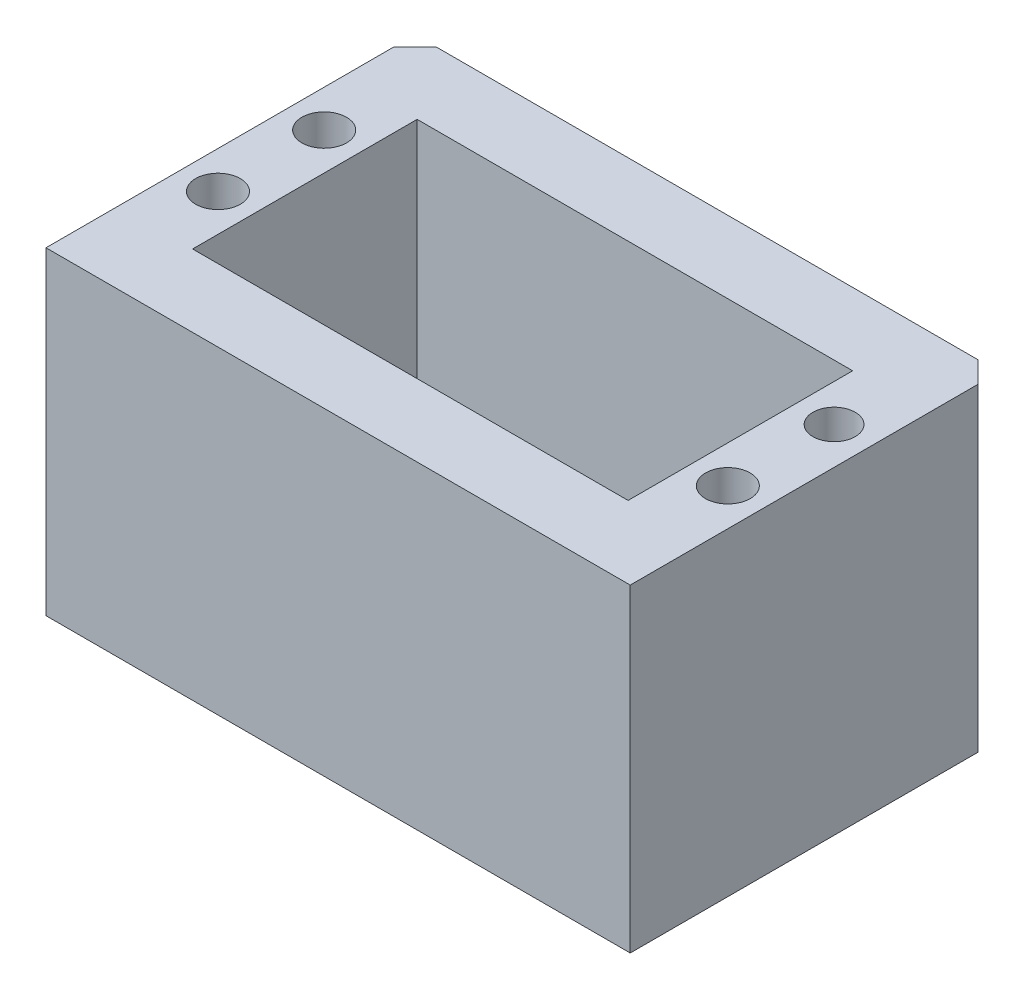
ISO-10303-21;
HEADER;
FILE_DESCRIPTION(('STEP AP214'),'2;1');
FILE_NAME('part.step','',(''),(''),'','','');
FILE_SCHEMA(('AUTOMOTIVE_DESIGN { 1 0 10303 214 1 1 1 1 }'));
ENDSEC;
DATA;
#1=APPLICATION_CONTEXT('core data for automotive mechanical design processes');
#2=APPLICATION_PROTOCOL_DEFINITION('international standard','automotive_design',2000,#1);
#3=PRODUCT_CONTEXT('',#1,'mechanical');
#4=PRODUCT('Part','Part','',(#3));
#5=PRODUCT_RELATED_PRODUCT_CATEGORY('part','',(#4));
#6=PRODUCT_DEFINITION_FORMATION('','',#4);
#7=PRODUCT_DEFINITION_CONTEXT('part definition',#1,'design');
#8=PRODUCT_DEFINITION('design','',#6,#7);
#9=PRODUCT_DEFINITION_SHAPE('','',#8);
#10=(LENGTH_UNIT() NAMED_UNIT(*) SI_UNIT(.MILLI.,.METRE.));
#11=(NAMED_UNIT(*) PLANE_ANGLE_UNIT() SI_UNIT($,.RADIAN.));
#12=(NAMED_UNIT(*) SI_UNIT($,.STERADIAN.) SOLID_ANGLE_UNIT());
#13=UNCERTAINTY_MEASURE_WITH_UNIT(LENGTH_MEASURE(1.E-05),#10,'distance_accuracy_value','');
#14=(GEOMETRIC_REPRESENTATION_CONTEXT(3) GLOBAL_UNCERTAINTY_ASSIGNED_CONTEXT((#13)) GLOBAL_UNIT_ASSIGNED_CONTEXT((#10,
#11,#12)) REPRESENTATION_CONTEXT('',''));
#15=CARTESIAN_POINT('',(0.,0.,0.));
#16=DIRECTION('',(0.,0.,1.));
#17=DIRECTION('',(1.,0.,0.));
#18=AXIS2_PLACEMENT_3D('',#15,#16,#17);
#19=CARTESIAN_POINT('',(0.,30.,0.));
#20=DIRECTION('',(1.,0.,0.));
#21=DIRECTION('',(0.,0.,-1.));
#22=AXIS2_PLACEMENT_3D('',#19,#20,#21);
#23=PLANE('',#22);
#24=DIRECTION('',(0.,0.,1.));
#25=VECTOR('',#24,1.);
#26=CARTESIAN_POINT('',(0.,4.4,-21.1901532724234));
#27=LINE('',#26,#25);
#28=CARTESIAN_POINT('',(0.,4.4,-21.1901532724234));
#29=VERTEX_POINT('',#28);
#30=CARTESIAN_POINT('',(0.,4.4,-14.1901532724234));
#31=VERTEX_POINT('',#30);
#32=EDGE_CURVE('E156',#29,#31,#27,.T.);
#33=ORIENTED_EDGE('',*,*,#32,.F.);
#34=DIRECTION('',(0.,-1.,0.));
#35=VECTOR('',#34,1.);
#36=CARTESIAN_POINT('',(0.,8.6,-21.1901532724234));
#37=LINE('',#36,#35);
#38=CARTESIAN_POINT('',(0.,8.6,-21.1901532724234));
#39=VERTEX_POINT('',#38);
#40=EDGE_CURVE('E161',#39,#29,#37,.T.);
#41=ORIENTED_EDGE('',*,*,#40,.F.);
#42=DIRECTION('',(0.,0.,-1.));
#43=VECTOR('',#42,1.);
#44=CARTESIAN_POINT('',(0.,8.6,-21.1901532724234));
#45=LINE('',#44,#43);
#46=CARTESIAN_POINT('',(0.,8.6,-14.1901532724234));
#47=VERTEX_POINT('',#46);
#48=EDGE_CURVE('E165',#47,#39,#45,.T.);
#49=ORIENTED_EDGE('',*,*,#48,.F.);
#50=DIRECTION('',(0.,1.,0.));
#51=VECTOR('',#50,1.);
#52=CARTESIAN_POINT('',(0.,8.6,-14.1901532724234));
#53=LINE('',#52,#51);
#54=EDGE_CURVE('E145',#31,#47,#53,.T.);
#55=ORIENTED_EDGE('',*,*,#54,.F.);
#56=EDGE_LOOP('',(#33,#41,#49,#55));
#57=FACE_BOUND('',#56,.T.);
#58=DIRECTION('',(0.,0.,1.));
#59=VECTOR('',#58,1.);
#60=CARTESIAN_POINT('',(0.,30.,0.));
#61=LINE('',#60,#59);
#62=CARTESIAN_POINT('',(0.,30.,-32.7401532724234));
#63=VERTEX_POINT('',#62);
#64=CARTESIAN_POINT('',(0.,30.,0.));
#65=VERTEX_POINT('',#64);
#66=EDGE_CURVE('E207',#63,#65,#61,.T.);
#67=ORIENTED_EDGE('',*,*,#66,.F.);
#68=DIRECTION('',(0.,-1.,0.));
#69=VECTOR('',#68,1.);
#70=CARTESIAN_POINT('',(0.,30.,-32.7401532724234));
#71=LINE('',#70,#69);
#72=CARTESIAN_POINT('',(0.,0.,-32.7401532724234));
#73=VERTEX_POINT('',#72);
#74=EDGE_CURVE('E11',#63,#73,#71,.T.);
#75=ORIENTED_EDGE('',*,*,#74,.T.);
#76=DIRECTION('',(0.,0.,1.));
#77=VECTOR('',#76,1.);
#78=CARTESIAN_POINT('',(0.,0.,0.));
#79=LINE('',#78,#77);
#80=CARTESIAN_POINT('',(0.,0.,0.));
#81=VERTEX_POINT('',#80);
#82=EDGE_CURVE('E200',#73,#81,#79,.T.);
#83=ORIENTED_EDGE('',*,*,#82,.T.);
#84=DIRECTION('',(0.,-1.,0.));
#85=VECTOR('',#84,1.);
#86=CARTESIAN_POINT('',(0.,30.,0.));
#87=LINE('',#86,#85);
#88=EDGE_CURVE('E226',#65,#81,#87,.T.);
#89=ORIENTED_EDGE('',*,*,#88,.F.);
#90=EDGE_LOOP('',(#67,#75,#83,#89));
#91=FACE_BOUND('',#90,.T.);
#92=ADVANCED_FACE('F35',(#57,#91),#23,.F.);
#93=CARTESIAN_POINT('',(0.,30.,0.));
#94=DIRECTION('',(0.,0.,-1.));
#95=DIRECTION('',(-1.,0.,0.));
#96=AXIS2_PLACEMENT_3D('',#93,#94,#95);
#97=PLANE('',#96);
#98=DIRECTION('',(1.,0.,0.));
#99=VECTOR('',#98,1.);
#100=CARTESIAN_POINT('',(0.,0.,0.));
#101=LINE('',#100,#99);
#102=CARTESIAN_POINT('',(55.,0.,0.));
#103=VERTEX_POINT('',#102);
#104=EDGE_CURVE('E218',#81,#103,#101,.T.);
#105=ORIENTED_EDGE('',*,*,#104,.T.);
#106=DIRECTION('',(0.,-1.,0.));
#107=VECTOR('',#106,1.);
#108=CARTESIAN_POINT('',(55.,30.,0.));
#109=LINE('',#108,#107);
#110=CARTESIAN_POINT('',(55.,30.,0.));
#111=VERTEX_POINT('',#110);
#112=EDGE_CURVE('E216',#111,#103,#109,.T.);
#113=ORIENTED_EDGE('',*,*,#112,.F.);
#114=DIRECTION('',(1.,0.,0.));
#115=VECTOR('',#114,1.);
#116=CARTESIAN_POINT('',(0.,30.,0.));
#117=LINE('',#116,#115);
#118=EDGE_CURVE('E209',#65,#111,#117,.T.);
#119=ORIENTED_EDGE('',*,*,#118,.F.);
#120=ORIENTED_EDGE('',*,*,#88,.T.);
#121=EDGE_LOOP('',(#105,#113,#119,#120));
#122=FACE_BOUND('',#121,.T.);
#123=ADVANCED_FACE('F266',(#122),#97,.F.);
#124=CARTESIAN_POINT('',(55.,30.,0.));
#125=DIRECTION('',(-1.,0.,0.));
#126=DIRECTION('',(0.,0.,1.));
#127=AXIS2_PLACEMENT_3D('',#124,#125,#126);
#128=PLANE('',#127);
#129=DIRECTION('',(0.,0.,-1.));
#130=VECTOR('',#129,1.);
#131=CARTESIAN_POINT('',(55.,0.,0.));
#132=LINE('',#131,#130);
#133=CARTESIAN_POINT('',(55.,0.,-32.7401532724234));
#134=VERTEX_POINT('',#133);
#135=EDGE_CURVE('E220',#103,#134,#132,.T.);
#136=ORIENTED_EDGE('',*,*,#135,.T.);
#137=DIRECTION('',(0.,1.,0.));
#138=VECTOR('',#137,1.);
#139=CARTESIAN_POINT('',(55.,30.,-32.7401532724234));
#140=LINE('',#139,#138);
#141=CARTESIAN_POINT('',(55.,30.,-32.7401532724234));
#142=VERTEX_POINT('',#141);
#143=EDGE_CURVE('E59',#134,#142,#140,.T.);
#144=ORIENTED_EDGE('',*,*,#143,.T.);
#145=DIRECTION('',(0.,0.,-1.));
#146=VECTOR('',#145,1.);
#147=CARTESIAN_POINT('',(55.,30.,0.));
#148=LINE('',#147,#146);
#149=EDGE_CURVE('E212',#111,#142,#148,.T.);
#150=ORIENTED_EDGE('',*,*,#149,.F.);
#151=ORIENTED_EDGE('',*,*,#112,.T.);
#152=EDGE_LOOP('',(#136,#144,#150,#151));
#153=FACE_BOUND('',#152,.T.);
#154=ADVANCED_FACE('F262',(#153),#128,.F.);
#155=CARTESIAN_POINT('',(0.,30.,-34.7401532724234));
#156=DIRECTION('',(0.,0.,1.));
#157=DIRECTION('',(1.,0.,0.));
#158=AXIS2_PLACEMENT_3D('',#155,#156,#157);
#159=PLANE('',#158);
#160=DIRECTION('',(-1.,0.,0.));
#161=VECTOR('',#160,1.);
#162=CARTESIAN_POINT('',(0.,30.,-34.7401532724234));
#163=LINE('',#162,#161);
#164=CARTESIAN_POINT('',(53.,30.,-34.7401532724234));
#165=VERTEX_POINT('',#164);
#166=CARTESIAN_POINT('',(2.,30.,-34.7401532724234));
#167=VERTEX_POINT('',#166);
#168=EDGE_CURVE('E214',#165,#167,#163,.T.);
#169=ORIENTED_EDGE('',*,*,#168,.F.);
#170=DIRECTION('',(0.,-1.,0.));
#171=VECTOR('',#170,1.);
#172=CARTESIAN_POINT('',(53.,30.,-34.7401532724234));
#173=LINE('',#172,#171);
#174=CARTESIAN_POINT('',(53.,0.,-34.7401532724234));
#175=VERTEX_POINT('',#174);
#176=EDGE_CURVE('E240',#165,#175,#173,.T.);
#177=ORIENTED_EDGE('',*,*,#176,.T.);
#178=DIRECTION('',(-1.,0.,0.));
#179=VECTOR('',#178,1.);
#180=CARTESIAN_POINT('',(0.,0.,-34.7401532724234));
#181=LINE('',#180,#179);
#182=CARTESIAN_POINT('',(2.,0.,-34.7401532724234));
#183=VERTEX_POINT('',#182);
#184=EDGE_CURVE('E210',#175,#183,#181,.T.);
#185=ORIENTED_EDGE('',*,*,#184,.T.);
#186=DIRECTION('',(0.,1.,0.));
#187=VECTOR('',#186,1.);
#188=CARTESIAN_POINT('',(2.,30.,-34.7401532724234));
#189=LINE('',#188,#187);
#190=EDGE_CURVE('E238',#183,#167,#189,.T.);
#191=ORIENTED_EDGE('',*,*,#190,.T.);
#192=EDGE_LOOP('',(#169,#177,#185,#191));
#193=FACE_BOUND('',#192,.T.);
#194=ADVANCED_FACE('F254',(#193),#159,.F.);
#195=CARTESIAN_POINT('',(0.,30.,0.));
#196=DIRECTION('',(0.,-1.,0.));
#197=DIRECTION('',(0.,0.,-1.));
#198=AXIS2_PLACEMENT_3D('',#195,#196,#197);
#199=PLANE('',#198);
#200=CARTESIAN_POINT('',(51.5,30.,-22.6901532724234));
#201=DIRECTION('',(0.,1.,0.));
#202=DIRECTION('',(0.,0.,1.));
#203=AXIS2_PLACEMENT_3D('',#200,#201,#202);
#204=CIRCLE('',#203,1.99312568997932);
#205=CARTESIAN_POINT('',(51.5,30.,-20.6970275824441));
#206=VERTEX_POINT('',#205);
#207=EDGE_CURVE('E373',#206,#206,#204,.T.);
#208=ORIENTED_EDGE('',*,*,#207,.F.);
#209=EDGE_LOOP('',(#208));
#210=FACE_BOUND('',#209,.T.);
#211=CARTESIAN_POINT('',(51.5,30.,-12.6901532724234));
#212=DIRECTION('',(0.,1.,0.));
#213=DIRECTION('',(0.,0.,1.));
#214=AXIS2_PLACEMENT_3D('',#211,#212,#213);
#215=CIRCLE('',#214,2.1);
#216=CARTESIAN_POINT('',(51.5,30.,-10.5901532724234));
#217=VERTEX_POINT('',#216);
#218=EDGE_CURVE('E392',#217,#217,#215,.T.);
#219=ORIENTED_EDGE('',*,*,#218,.F.);
#220=EDGE_LOOP('',(#219));
#221=FACE_BOUND('',#220,.T.);
#222=CARTESIAN_POINT('',(3.49999999999999,30.,-12.6901532724234));
#223=DIRECTION('',(0.,1.,0.));
#224=DIRECTION('',(0.,0.,1.));
#225=AXIS2_PLACEMENT_3D('',#222,#223,#224);
#226=CIRCLE('',#225,2.1);
#227=CARTESIAN_POINT('',(3.49999999999999,30.,-10.5901532724234));
#228=VERTEX_POINT('',#227);
#229=EDGE_CURVE('E386',#228,#228,#226,.T.);
#230=ORIENTED_EDGE('',*,*,#229,.F.);
#231=EDGE_LOOP('',(#230));
#232=FACE_BOUND('',#231,.T.);
#233=CARTESIAN_POINT('',(3.49999999999999,30.,-22.6901532724234));
#234=DIRECTION('',(0.,1.,0.));
#235=DIRECTION('',(0.,0.,1.));
#236=AXIS2_PLACEMENT_3D('',#233,#234,#235);
#237=CIRCLE('',#236,2.1);
#238=CARTESIAN_POINT('',(3.49999999999999,30.,-20.5901532724234));
#239=VERTEX_POINT('',#238);
#240=EDGE_CURVE('E385',#239,#239,#237,.T.);
#241=ORIENTED_EDGE('',*,*,#240,.F.);
#242=EDGE_LOOP('',(#241));
#243=FACE_BOUND('',#242,.T.);
#244=DIRECTION('',(1.,0.,0.));
#245=VECTOR('',#244,1.);
#246=CARTESIAN_POINT('',(7.,30.,-6.8));
#247=LINE('',#246,#245);
#248=CARTESIAN_POINT('',(7.,30.,-6.8));
#249=VERTEX_POINT('',#248);
#250=CARTESIAN_POINT('',(48.,30.,-6.80000000000001));
#251=VERTEX_POINT('',#250);
#252=EDGE_CURVE('E190',#249,#251,#247,.T.);
#253=ORIENTED_EDGE('',*,*,#252,.F.);
#254=DIRECTION('',(0.,0.,1.));
#255=VECTOR('',#254,1.);
#256=CARTESIAN_POINT('',(7.,30.,-27.9401532724234));
#257=LINE('',#256,#255);
#258=CARTESIAN_POINT('',(7.,30.,-27.9401532724234));
#259=VERTEX_POINT('',#258);
#260=EDGE_CURVE('E172',#259,#249,#257,.T.);
#261=ORIENTED_EDGE('',*,*,#260,.F.);
#262=DIRECTION('',(-1.,0.,0.));
#263=VECTOR('',#262,1.);
#264=CARTESIAN_POINT('',(7.,30.,-27.9401532724234));
#265=LINE('',#264,#263);
#266=CARTESIAN_POINT('',(48.,30.,-27.9401532724234));
#267=VERTEX_POINT('',#266);
#268=EDGE_CURVE('E179',#267,#259,#265,.T.);
#269=ORIENTED_EDGE('',*,*,#268,.F.);
#270=DIRECTION('',(0.,0.,-1.));
#271=VECTOR('',#270,1.);
#272=CARTESIAN_POINT('',(48.,30.,-27.9401532724234));
#273=LINE('',#272,#271);
#274=EDGE_CURVE('E193',#251,#267,#273,.T.);
#275=ORIENTED_EDGE('',*,*,#274,.F.);
#276=EDGE_LOOP('',(#253,#261,#269,#275));
#277=FACE_BOUND('',#276,.T.);
#278=ORIENTED_EDGE('',*,*,#149,.T.);
#279=DIRECTION('',(0.707106781186546,0.,0.707106781186549));
#280=VECTOR('',#279,1.);
#281=CARTESIAN_POINT('',(53.,30.,-34.7401532724234));
#282=LINE('',#281,#280);
#283=EDGE_CURVE('E44',#142,#165,#282,.F.);
#284=ORIENTED_EDGE('',*,*,#283,.T.);
#285=ORIENTED_EDGE('',*,*,#168,.T.);
#286=DIRECTION('',(0.707106781186548,0.,-0.707106781186548));
#287=VECTOR('',#286,1.);
#288=CARTESIAN_POINT('',(0.,30.,-32.7401532724234));
#289=LINE('',#288,#287);
#290=EDGE_CURVE('E51',#167,#63,#289,.F.);
#291=ORIENTED_EDGE('',*,*,#290,.T.);
#292=ORIENTED_EDGE('',*,*,#66,.T.);
#293=ORIENTED_EDGE('',*,*,#118,.T.);
#294=EDGE_LOOP('',(#278,#284,#285,#291,#292,#293));
#295=FACE_BOUND('',#294,.T.);
#296=ADVANCED_FACE('F250',(#210,#221,#232,#243,#277,#295),#199,.F.);
#297=CARTESIAN_POINT('',(0.,0.,0.));
#298=DIRECTION('',(0.,-1.,0.));
#299=DIRECTION('',(0.,0.,-1.));
#300=AXIS2_PLACEMENT_3D('',#297,#298,#299);
#301=PLANE('',#300);
#302=CARTESIAN_POINT('',(17.25,0.,-17.6901532724234));
#303=DIRECTION('',(0.,-1.,0.));
#304=DIRECTION('',(0.,0.,-1.));
#305=AXIS2_PLACEMENT_3D('',#302,#303,#304);
#306=CIRCLE('',#305,3.99999999999998);
#307=CARTESIAN_POINT('',(17.25,0.,-21.6901532724234));
#308=VERTEX_POINT('',#307);
#309=EDGE_CURVE('E374',#308,#308,#306,.T.);
#310=ORIENTED_EDGE('',*,*,#309,.F.);
#311=EDGE_LOOP('',(#310));
#312=FACE_BOUND('',#311,.T.);
#313=ORIENTED_EDGE('',*,*,#184,.F.);
#314=DIRECTION('',(-0.707106781186546,0.,-0.707106781186549));
#315=VECTOR('',#314,1.);
#316=CARTESIAN_POINT('',(43.8700766362118,0.,-43.8700766362116));
#317=LINE('',#316,#315);
#318=EDGE_CURVE('E245',#175,#134,#317,.F.);
#319=ORIENTED_EDGE('',*,*,#318,.T.);
#320=ORIENTED_EDGE('',*,*,#135,.F.);
#321=ORIENTED_EDGE('',*,*,#104,.F.);
#322=ORIENTED_EDGE('',*,*,#82,.F.);
#323=DIRECTION('',(-0.707106781186548,0.,0.707106781186548));
#324=VECTOR('',#323,1.);
#325=CARTESIAN_POINT('',(-16.3700766362117,0.,-16.3700766362117));
#326=LINE('',#325,#324);
#327=EDGE_CURVE('E243',#73,#183,#326,.F.);
#328=ORIENTED_EDGE('',*,*,#327,.T.);
#329=EDGE_LOOP('',(#313,#319,#320,#321,#322,#328));
#330=FACE_BOUND('',#329,.T.);
#331=ADVANCED_FACE('F260',(#312,#330),#301,.T.);
#332=CARTESIAN_POINT('',(7.,1.13,-27.9401532724234));
#333=DIRECTION('',(-1.,0.,0.));
#334=DIRECTION('',(0.,0.,1.));
#335=AXIS2_PLACEMENT_3D('',#332,#333,#334);
#336=PLANE('',#335);
#337=DIRECTION('',(0.,0.,-1.));
#338=VECTOR('',#337,1.);
#339=CARTESIAN_POINT('',(7.,8.6,-27.9401532724234));
#340=LINE('',#339,#338);
#341=CARTESIAN_POINT('',(7.,8.6,-14.1901532724234));
#342=VERTEX_POINT('',#341);
#343=CARTESIAN_POINT('',(7.,8.6,-21.1901532724234));
#344=VERTEX_POINT('',#343);
#345=EDGE_CURVE('E232',#342,#344,#340,.T.);
#346=ORIENTED_EDGE('',*,*,#345,.T.);
#347=DIRECTION('',(0.,-1.,0.));
#348=VECTOR('',#347,1.);
#349=CARTESIAN_POINT('',(7.,1.13,-21.1901532724234));
#350=LINE('',#349,#348);
#351=CARTESIAN_POINT('',(7.,4.4,-21.1901532724234));
#352=VERTEX_POINT('',#351);
#353=EDGE_CURVE('E235',#344,#352,#350,.T.);
#354=ORIENTED_EDGE('',*,*,#353,.T.);
#355=DIRECTION('',(0.,0.,1.));
#356=VECTOR('',#355,1.);
#357=CARTESIAN_POINT('',(7.,4.4,-27.9401532724234));
#358=LINE('',#357,#356);
#359=CARTESIAN_POINT('',(7.,4.4,-14.1901532724234));
#360=VERTEX_POINT('',#359);
#361=EDGE_CURVE('E229',#352,#360,#358,.T.);
#362=ORIENTED_EDGE('',*,*,#361,.T.);
#363=DIRECTION('',(0.,1.,0.));
#364=VECTOR('',#363,1.);
#365=CARTESIAN_POINT('',(7.,1.13,-14.1901532724234));
#366=LINE('',#365,#364);
#367=EDGE_CURVE('E148',#360,#342,#366,.T.);
#368=ORIENTED_EDGE('',*,*,#367,.T.);
#369=EDGE_LOOP('',(#346,#354,#362,#368));
#370=FACE_BOUND('',#369,.T.);
#371=ORIENTED_EDGE('',*,*,#260,.T.);
#372=DIRECTION('',(0.,1.,0.));
#373=VECTOR('',#372,1.);
#374=CARTESIAN_POINT('',(7.,1.13,-6.8));
#375=LINE('',#374,#373);
#376=CARTESIAN_POINT('',(7.,1.13,-6.8));
#377=VERTEX_POINT('',#376);
#378=EDGE_CURVE('E188',#377,#249,#375,.T.);
#379=ORIENTED_EDGE('',*,*,#378,.F.);
#380=DIRECTION('',(0.,0.,1.));
#381=VECTOR('',#380,1.);
#382=CARTESIAN_POINT('',(7.,1.13,-27.9401532724234));
#383=LINE('',#382,#381);
#384=CARTESIAN_POINT('',(7.,1.13,-27.9401532724234));
#385=VERTEX_POINT('',#384);
#386=EDGE_CURVE('E175',#385,#377,#383,.T.);
#387=ORIENTED_EDGE('',*,*,#386,.F.);
#388=DIRECTION('',(0.,1.,0.));
#389=VECTOR('',#388,1.);
#390=CARTESIAN_POINT('',(7.,1.13,-27.9401532724234));
#391=LINE('',#390,#389);
#392=EDGE_CURVE('E198',#385,#259,#391,.T.);
#393=ORIENTED_EDGE('',*,*,#392,.T.);
#394=EDGE_LOOP('',(#371,#379,#387,#393));
#395=FACE_BOUND('',#394,.T.);
#396=ADVANCED_FACE('F294',(#370,#395),#336,.F.);
#397=CARTESIAN_POINT('',(7.,1.13,-27.9401532724234));
#398=DIRECTION('',(0.,0.,-1.));
#399=DIRECTION('',(-1.,0.,0.));
#400=AXIS2_PLACEMENT_3D('',#397,#398,#399);
#401=PLANE('',#400);
#402=ORIENTED_EDGE('',*,*,#268,.T.);
#403=ORIENTED_EDGE('',*,*,#392,.F.);
#404=DIRECTION('',(-1.,0.,0.));
#405=VECTOR('',#404,1.);
#406=CARTESIAN_POINT('',(7.,1.13,-27.9401532724234));
#407=LINE('',#406,#405);
#408=CARTESIAN_POINT('',(48.,1.13,-27.9401532724234));
#409=VERTEX_POINT('',#408);
#410=EDGE_CURVE('E185',#409,#385,#407,.T.);
#411=ORIENTED_EDGE('',*,*,#410,.F.);
#412=DIRECTION('',(0.,1.,0.));
#413=VECTOR('',#412,1.);
#414=CARTESIAN_POINT('',(48.,1.13,-27.9401532724234));
#415=LINE('',#414,#413);
#416=EDGE_CURVE('E201',#409,#267,#415,.T.);
#417=ORIENTED_EDGE('',*,*,#416,.T.);
#418=EDGE_LOOP('',(#402,#403,#411,#417));
#419=FACE_BOUND('',#418,.T.);
#420=ADVANCED_FACE('F301',(#419),#401,.F.);
#421=CARTESIAN_POINT('',(48.,1.13,-27.9401532724234));
#422=DIRECTION('',(1.,0.,0.));
#423=DIRECTION('',(0.,0.,-1.));
#424=AXIS2_PLACEMENT_3D('',#421,#422,#423);
#425=PLANE('',#424);
#426=ORIENTED_EDGE('',*,*,#274,.T.);
#427=ORIENTED_EDGE('',*,*,#416,.F.);
#428=DIRECTION('',(0.,0.,-1.));
#429=VECTOR('',#428,1.);
#430=CARTESIAN_POINT('',(48.,1.13,-27.9401532724234));
#431=LINE('',#430,#429);
#432=CARTESIAN_POINT('',(48.,1.13,-6.80000000000001));
#433=VERTEX_POINT('',#432);
#434=EDGE_CURVE('E182',#433,#409,#431,.T.);
#435=ORIENTED_EDGE('',*,*,#434,.F.);
#436=DIRECTION('',(0.,1.,0.));
#437=VECTOR('',#436,1.);
#438=CARTESIAN_POINT('',(48.,1.13,-6.80000000000001));
#439=LINE('',#438,#437);
#440=EDGE_CURVE('E203',#433,#251,#439,.T.);
#441=ORIENTED_EDGE('',*,*,#440,.T.);
#442=EDGE_LOOP('',(#426,#427,#435,#441));
#443=FACE_BOUND('',#442,.T.);
#444=ADVANCED_FACE('F307',(#443),#425,.F.);
#445=CARTESIAN_POINT('',(7.,1.13,-6.8));
#446=DIRECTION('',(0.,0.,1.));
#447=DIRECTION('',(1.,0.,0.));
#448=AXIS2_PLACEMENT_3D('',#445,#446,#447);
#449=PLANE('',#448);
#450=ORIENTED_EDGE('',*,*,#252,.T.);
#451=ORIENTED_EDGE('',*,*,#440,.F.);
#452=DIRECTION('',(1.,0.,0.));
#453=VECTOR('',#452,1.);
#454=CARTESIAN_POINT('',(7.,1.13,-6.8));
#455=LINE('',#454,#453);
#456=EDGE_CURVE('E178',#377,#433,#455,.T.);
#457=ORIENTED_EDGE('',*,*,#456,.F.);
#458=ORIENTED_EDGE('',*,*,#378,.T.);
#459=EDGE_LOOP('',(#450,#451,#457,#458));
#460=FACE_BOUND('',#459,.T.);
#461=ADVANCED_FACE('F303',(#460),#449,.F.);
#462=CARTESIAN_POINT('',(0.,1.13,0.));
#463=DIRECTION('',(0.,1.,0.));
#464=DIRECTION('',(0.,0.,1.));
#465=AXIS2_PLACEMENT_3D('',#462,#463,#464);
#466=PLANE('',#465);
#467=ORIENTED_EDGE('',*,*,#386,.T.);
#468=ORIENTED_EDGE('',*,*,#456,.T.);
#469=ORIENTED_EDGE('',*,*,#434,.T.);
#470=ORIENTED_EDGE('',*,*,#410,.T.);
#471=EDGE_LOOP('',(#467,#468,#469,#470));
#472=FACE_BOUND('',#471,.T.);
#473=ADVANCED_FACE('F306',(#472),#466,.T.);
#474=CARTESIAN_POINT('',(10.,8.6,-21.1901532724234));
#475=DIRECTION('',(0.,0.,-1.));
#476=DIRECTION('',(-1.,0.,0.));
#477=AXIS2_PLACEMENT_3D('',#474,#475,#476);
#478=PLANE('',#477);
#479=DIRECTION('',(-1.,0.,0.));
#480=VECTOR('',#479,1.);
#481=CARTESIAN_POINT('',(10.,8.6,-21.1901532724234));
#482=LINE('',#481,#480);
#483=EDGE_CURVE('E170',#344,#39,#482,.T.);
#484=ORIENTED_EDGE('',*,*,#483,.T.);
#485=ORIENTED_EDGE('',*,*,#40,.T.);
#486=DIRECTION('',(-1.,0.,0.));
#487=VECTOR('',#486,1.);
#488=CARTESIAN_POINT('',(10.,4.4,-21.1901532724234));
#489=LINE('',#488,#487);
#490=EDGE_CURVE('E152',#352,#29,#489,.T.);
#491=ORIENTED_EDGE('',*,*,#490,.F.);
#492=ORIENTED_EDGE('',*,*,#353,.F.);
#493=EDGE_LOOP('',(#484,#485,#491,#492));
#494=FACE_BOUND('',#493,.T.);
#495=ADVANCED_FACE('F317',(#494),#478,.F.);
#496=CARTESIAN_POINT('',(10.,8.6,-21.1901532724234));
#497=DIRECTION('',(0.,1.,0.));
#498=DIRECTION('',(0.,0.,1.));
#499=AXIS2_PLACEMENT_3D('',#496,#497,#498);
#500=PLANE('',#499);
#501=DIRECTION('',(-1.,0.,0.));
#502=VECTOR('',#501,1.);
#503=CARTESIAN_POINT('',(10.,8.6,-14.1901532724234));
#504=LINE('',#503,#502);
#505=EDGE_CURVE('E151',#342,#47,#504,.T.);
#506=ORIENTED_EDGE('',*,*,#505,.T.);
#507=ORIENTED_EDGE('',*,*,#48,.T.);
#508=ORIENTED_EDGE('',*,*,#483,.F.);
#509=ORIENTED_EDGE('',*,*,#345,.F.);
#510=EDGE_LOOP('',(#506,#507,#508,#509));
#511=FACE_BOUND('',#510,.T.);
#512=ADVANCED_FACE('F321',(#511),#500,.F.);
#513=CARTESIAN_POINT('',(10.,8.6,-14.1901532724234));
#514=DIRECTION('',(0.,0.,1.));
#515=DIRECTION('',(1.,0.,0.));
#516=AXIS2_PLACEMENT_3D('',#513,#514,#515);
#517=PLANE('',#516);
#518=DIRECTION('',(-1.,0.,0.));
#519=VECTOR('',#518,1.);
#520=CARTESIAN_POINT('',(10.,4.4,-14.1901532724234));
#521=LINE('',#520,#519);
#522=EDGE_CURVE('E140',#360,#31,#521,.T.);
#523=ORIENTED_EDGE('',*,*,#522,.T.);
#524=ORIENTED_EDGE('',*,*,#54,.T.);
#525=ORIENTED_EDGE('',*,*,#505,.F.);
#526=ORIENTED_EDGE('',*,*,#367,.F.);
#527=EDGE_LOOP('',(#523,#524,#525,#526));
#528=FACE_BOUND('',#527,.T.);
#529=ADVANCED_FACE('F142',(#528),#517,.F.);
#530=CARTESIAN_POINT('',(10.,4.4,-21.1901532724234));
#531=DIRECTION('',(0.,-1.,0.));
#532=DIRECTION('',(0.,0.,-1.));
#533=AXIS2_PLACEMENT_3D('',#530,#531,#532);
#534=PLANE('',#533);
#535=ORIENTED_EDGE('',*,*,#490,.T.);
#536=ORIENTED_EDGE('',*,*,#32,.T.);
#537=ORIENTED_EDGE('',*,*,#522,.F.);
#538=ORIENTED_EDGE('',*,*,#361,.F.);
#539=EDGE_LOOP('',(#535,#536,#537,#538));
#540=FACE_BOUND('',#539,.T.);
#541=ADVANCED_FACE('F157',(#540),#534,.F.);
#542=CARTESIAN_POINT('',(3.49999999999999,23.,-22.6901532724234));
#543=DIRECTION('',(0.,1.,0.));
#544=DIRECTION('',(0.,0.,1.));
#545=AXIS2_PLACEMENT_3D('',#542,#543,#544);
#546=CYLINDRICAL_SURFACE('',#545,2.1);
#547=CARTESIAN_POINT('',(3.49999999999999,23.,-22.6901532724234));
#548=DIRECTION('',(0.,1.,0.));
#549=DIRECTION('',(0.,0.,1.));
#550=AXIS2_PLACEMENT_3D('',#547,#548,#549);
#551=CIRCLE('',#550,2.1);
#552=CARTESIAN_POINT('',(3.49999999999999,23.,-20.5901532724234));
#553=VERTEX_POINT('',#552);
#554=EDGE_CURVE('E397',#553,#553,#551,.T.);
#555=ORIENTED_EDGE('',*,*,#554,.F.);
#556=EDGE_LOOP('',(#555));
#557=FACE_BOUND('',#556,.T.);
#558=ORIENTED_EDGE('',*,*,#240,.T.);
#559=EDGE_LOOP('',(#558));
#560=FACE_BOUND('',#559,.T.);
#561=ADVANCED_FACE('F325',(#557,#560),#546,.F.);
#562=CARTESIAN_POINT('',(3.49999999999999,23.,-22.6901532724234));
#563=DIRECTION('',(0.,1.,0.));
#564=DIRECTION('',(0.,0.,1.));
#565=AXIS2_PLACEMENT_3D('',#562,#563,#564);
#566=PLANE('',#565);
#567=ORIENTED_EDGE('',*,*,#554,.T.);
#568=EDGE_LOOP('',(#567));
#569=FACE_BOUND('',#568,.T.);
#570=ADVANCED_FACE('F333',(#569),#566,.T.);
#571=CARTESIAN_POINT('',(3.49999999999999,23.,-12.6901532724234));
#572=DIRECTION('',(0.,1.,0.));
#573=DIRECTION('',(0.,0.,1.));
#574=AXIS2_PLACEMENT_3D('',#571,#572,#573);
#575=CYLINDRICAL_SURFACE('',#574,2.1);
#576=CARTESIAN_POINT('',(3.49999999999999,23.,-12.6901532724234));
#577=DIRECTION('',(0.,1.,0.));
#578=DIRECTION('',(0.,0.,1.));
#579=AXIS2_PLACEMENT_3D('',#576,#577,#578);
#580=CIRCLE('',#579,2.1);
#581=CARTESIAN_POINT('',(3.49999999999999,23.,-10.5901532724234));
#582=VERTEX_POINT('',#581);
#583=EDGE_CURVE('E382',#582,#582,#580,.T.);
#584=ORIENTED_EDGE('',*,*,#583,.F.);
#585=EDGE_LOOP('',(#584));
#586=FACE_BOUND('',#585,.T.);
#587=ORIENTED_EDGE('',*,*,#229,.T.);
#588=EDGE_LOOP('',(#587));
#589=FACE_BOUND('',#588,.T.);
#590=ADVANCED_FACE('F337',(#586,#589),#575,.F.);
#591=CARTESIAN_POINT('',(3.49999999999999,23.,-12.6901532724234));
#592=DIRECTION('',(0.,1.,0.));
#593=DIRECTION('',(0.,0.,1.));
#594=AXIS2_PLACEMENT_3D('',#591,#592,#593);
#595=PLANE('',#594);
#596=ORIENTED_EDGE('',*,*,#583,.T.);
#597=EDGE_LOOP('',(#596));
#598=FACE_BOUND('',#597,.T.);
#599=ADVANCED_FACE('F352',(#598),#595,.T.);
#600=CARTESIAN_POINT('',(51.5,23.,-12.6901532724234));
#601=DIRECTION('',(0.,1.,0.));
#602=DIRECTION('',(0.,0.,1.));
#603=AXIS2_PLACEMENT_3D('',#600,#601,#602);
#604=CYLINDRICAL_SURFACE('',#603,2.1);
#605=CARTESIAN_POINT('',(51.5,23.,-12.6901532724234));
#606=DIRECTION('',(0.,1.,0.));
#607=DIRECTION('',(0.,0.,1.));
#608=AXIS2_PLACEMENT_3D('',#605,#606,#607);
#609=CIRCLE('',#608,2.1);
#610=CARTESIAN_POINT('',(51.5,23.,-10.5901532724234));
#611=VERTEX_POINT('',#610);
#612=EDGE_CURVE('E389',#611,#611,#609,.T.);
#613=ORIENTED_EDGE('',*,*,#612,.F.);
#614=EDGE_LOOP('',(#613));
#615=FACE_BOUND('',#614,.T.);
#616=ORIENTED_EDGE('',*,*,#218,.T.);
#617=EDGE_LOOP('',(#616));
#618=FACE_BOUND('',#617,.T.);
#619=ADVANCED_FACE('F349',(#615,#618),#604,.F.);
#620=CARTESIAN_POINT('',(51.5,23.,-12.6901532724234));
#621=DIRECTION('',(0.,1.,0.));
#622=DIRECTION('',(0.,0.,1.));
#623=AXIS2_PLACEMENT_3D('',#620,#621,#622);
#624=PLANE('',#623);
#625=ORIENTED_EDGE('',*,*,#612,.T.);
#626=EDGE_LOOP('',(#625));
#627=FACE_BOUND('',#626,.T.);
#628=ADVANCED_FACE('F343',(#627),#624,.T.);
#629=CARTESIAN_POINT('',(51.5,23.,-22.6901532724234));
#630=DIRECTION('',(0.,1.,0.));
#631=DIRECTION('',(0.,0.,1.));
#632=AXIS2_PLACEMENT_3D('',#629,#630,#631);
#633=CYLINDRICAL_SURFACE('',#632,1.99312568997932);
#634=CARTESIAN_POINT('',(51.5,23.,-22.6901532724234));
#635=DIRECTION('',(0.,1.,0.));
#636=DIRECTION('',(0.,0.,1.));
#637=AXIS2_PLACEMENT_3D('',#634,#635,#636);
#638=CIRCLE('',#637,1.99312568997932);
#639=CARTESIAN_POINT('',(51.5,23.,-20.6970275824441));
#640=VERTEX_POINT('',#639);
#641=EDGE_CURVE('E377',#640,#640,#638,.T.);
#642=ORIENTED_EDGE('',*,*,#641,.F.);
#643=EDGE_LOOP('',(#642));
#644=FACE_BOUND('',#643,.T.);
#645=ORIENTED_EDGE('',*,*,#207,.T.);
#646=EDGE_LOOP('',(#645));
#647=FACE_BOUND('',#646,.T.);
#648=ADVANCED_FACE('F339',(#644,#647),#633,.F.);
#649=CARTESIAN_POINT('',(51.5,23.,-22.6901532724234));
#650=DIRECTION('',(0.,1.,0.));
#651=DIRECTION('',(0.,0.,1.));
#652=AXIS2_PLACEMENT_3D('',#649,#650,#651);
#653=PLANE('',#652);
#654=ORIENTED_EDGE('',*,*,#641,.T.);
#655=EDGE_LOOP('',(#654));
#656=FACE_BOUND('',#655,.T.);
#657=ADVANCED_FACE('F342',(#656),#653,.T.);
#658=CARTESIAN_POINT('',(17.25,-12.,-17.6901532724234));
#659=DIRECTION('',(0.,1.,0.));
#660=DIRECTION('',(0.,0.,1.));
#661=AXIS2_PLACEMENT_3D('',#658,#659,#660);
#662=CYLINDRICAL_SURFACE('',#661,3.99999999999998);
#663=CARTESIAN_POINT('',(17.25,-12.,-17.6901532724234));
#664=DIRECTION('',(0.,-1.,0.));
#665=DIRECTION('',(0.,0.,-1.));
#666=AXIS2_PLACEMENT_3D('',#663,#664,#665);
#667=CIRCLE('',#666,3.99999999999998);
#668=CARTESIAN_POINT('',(17.25,-12.,-21.6901532724234));
#669=VERTEX_POINT('',#668);
#670=EDGE_CURVE('E372',#669,#669,#667,.T.);
#671=ORIENTED_EDGE('',*,*,#670,.F.);
#672=EDGE_LOOP('',(#671));
#673=FACE_BOUND('',#672,.T.);
#674=ORIENTED_EDGE('',*,*,#309,.T.);
#675=EDGE_LOOP('',(#674));
#676=FACE_BOUND('',#675,.T.);
#677=ADVANCED_FACE('F347',(#673,#676),#662,.T.);
#678=CARTESIAN_POINT('',(17.25,-12.,-17.6901532724234));
#679=DIRECTION('',(0.,-1.,0.));
#680=DIRECTION('',(0.,0.,-1.));
#681=AXIS2_PLACEMENT_3D('',#678,#679,#680);
#682=PLANE('',#681);
#683=ORIENTED_EDGE('',*,*,#670,.T.);
#684=EDGE_LOOP('',(#683));
#685=FACE_BOUND('',#684,.T.);
#686=ADVANCED_FACE('F275',(#685),#682,.T.);
#687=CARTESIAN_POINT('',(53.,30.,-34.7401532724234));
#688=DIRECTION('',(-0.707106781186549,0.,0.707106781186546));
#689=DIRECTION('',(0.,-1.,0.));
#690=AXIS2_PLACEMENT_3D('',#687,#688,#689);
#691=PLANE('',#690);
#692=ORIENTED_EDGE('',*,*,#283,.F.);
#693=ORIENTED_EDGE('',*,*,#143,.F.);
#694=ORIENTED_EDGE('',*,*,#318,.F.);
#695=ORIENTED_EDGE('',*,*,#176,.F.);
#696=EDGE_LOOP('',(#692,#693,#694,#695));
#697=FACE_BOUND('',#696,.T.);
#698=ADVANCED_FACE('F257',(#697),#691,.F.);
#699=CARTESIAN_POINT('',(0.,30.,-32.7401532724234));
#700=DIRECTION('',(0.707106781186547,0.,0.707106781186547));
#701=DIRECTION('',(0.,-1.,0.));
#702=AXIS2_PLACEMENT_3D('',#699,#700,#701);
#703=PLANE('',#702);
#704=ORIENTED_EDGE('',*,*,#290,.F.);
#705=ORIENTED_EDGE('',*,*,#190,.F.);
#706=ORIENTED_EDGE('',*,*,#327,.F.);
#707=ORIENTED_EDGE('',*,*,#74,.F.);
#708=EDGE_LOOP('',(#704,#705,#706,#707));
#709=FACE_BOUND('',#708,.T.);
#710=ADVANCED_FACE('F38',(#709),#703,.F.);
#711=CLOSED_SHELL('',(#92,#123,#154,#194,#296,#331,#396,#420,#444,#461,#473,#495,#512,#529,#541,
#561,#570,#590,#599,#619,#628,#648,#657,#677,#686,#698,#710));
#712=MANIFOLD_SOLID_BREP('B2',#711);
#713=ADVANCED_BREP_SHAPE_REPRESENTATION('',(#18,#712),#14);
#714=SHAPE_DEFINITION_REPRESENTATION(#9,#713);
ENDSEC;
END-ISO-10303-21;
